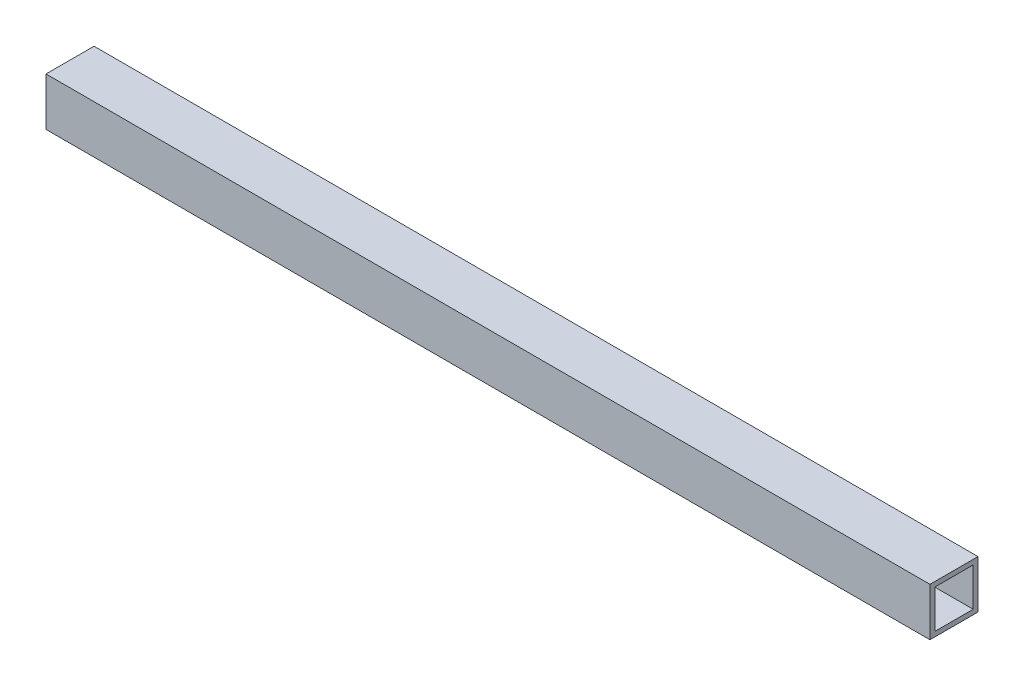
ISO-10303-21;
HEADER;
FILE_DESCRIPTION(('STEP AP214'),'2;1');
FILE_NAME('part.step','',(''),(''),'','','');
FILE_SCHEMA(('AUTOMOTIVE_DESIGN { 1 0 10303 214 1 1 1 1 }'));
ENDSEC;
DATA;
#1=APPLICATION_CONTEXT('core data for automotive mechanical design processes');
#2=APPLICATION_PROTOCOL_DEFINITION('international standard','automotive_design',2000,#1);
#3=PRODUCT_CONTEXT('',#1,'mechanical');
#4=PRODUCT('Part','Part','',(#3));
#5=PRODUCT_RELATED_PRODUCT_CATEGORY('part','',(#4));
#6=PRODUCT_DEFINITION_FORMATION('','',#4);
#7=PRODUCT_DEFINITION_CONTEXT('part definition',#1,'design');
#8=PRODUCT_DEFINITION('design','',#6,#7);
#9=PRODUCT_DEFINITION_SHAPE('','',#8);
#10=(LENGTH_UNIT() NAMED_UNIT(*) SI_UNIT(.MILLI.,.METRE.));
#11=(NAMED_UNIT(*) PLANE_ANGLE_UNIT() SI_UNIT($,.RADIAN.));
#12=(NAMED_UNIT(*) SI_UNIT($,.STERADIAN.) SOLID_ANGLE_UNIT());
#13=UNCERTAINTY_MEASURE_WITH_UNIT(LENGTH_MEASURE(1.E-05),#10,'distance_accuracy_value','');
#14=(GEOMETRIC_REPRESENTATION_CONTEXT(3) GLOBAL_UNCERTAINTY_ASSIGNED_CONTEXT((#13)) GLOBAL_UNIT_ASSIGNED_CONTEXT((#10,
#11,#12)) REPRESENTATION_CONTEXT('',''));
#15=CARTESIAN_POINT('',(0.,0.,0.));
#16=DIRECTION('',(0.,0.,1.));
#17=DIRECTION('',(1.,0.,0.));
#18=AXIS2_PLACEMENT_3D('',#15,#16,#17);
#19=CARTESIAN_POINT('',(584.2,0.,0.));
#20=DIRECTION('',(1.,0.,0.));
#21=DIRECTION('',(0.,0.,-1.));
#22=AXIS2_PLACEMENT_3D('',#19,#20,#21);
#23=PLANE('',#22);
#24=DIRECTION('',(0.,-1.,0.));
#25=VECTOR('',#24,1.);
#26=CARTESIAN_POINT('',(584.2,0.,3.175));
#27=LINE('',#26,#25);
#28=CARTESIAN_POINT('',(584.2,28.575,3.175));
#29=VERTEX_POINT('',#28);
#30=CARTESIAN_POINT('',(584.2,-3.175,3.175));
#31=VERTEX_POINT('',#30);
#32=EDGE_CURVE('E158',#29,#31,#27,.T.);
#33=ORIENTED_EDGE('',*,*,#32,.T.);
#34=DIRECTION('',(0.,0.,-1.));
#35=VECTOR('',#34,1.);
#36=CARTESIAN_POINT('',(584.2,-3.175,0.));
#37=LINE('',#36,#35);
#38=CARTESIAN_POINT('',(584.2,-3.175,-28.575));
#39=VERTEX_POINT('',#38);
#40=EDGE_CURVE('E161',#31,#39,#37,.T.);
#41=ORIENTED_EDGE('',*,*,#40,.T.);
#42=DIRECTION('',(0.,1.,0.));
#43=VECTOR('',#42,1.);
#44=CARTESIAN_POINT('',(584.2,0.,-28.575));
#45=LINE('',#44,#43);
#46=CARTESIAN_POINT('',(584.2,28.575,-28.575));
#47=VERTEX_POINT('',#46);
#48=EDGE_CURVE('E164',#39,#47,#45,.T.);
#49=ORIENTED_EDGE('',*,*,#48,.T.);
#50=DIRECTION('',(0.,0.,1.));
#51=VECTOR('',#50,1.);
#52=CARTESIAN_POINT('',(584.2,28.575,0.));
#53=LINE('',#52,#51);
#54=EDGE_CURVE('E166',#47,#29,#53,.T.);
#55=ORIENTED_EDGE('',*,*,#54,.T.);
#56=EDGE_LOOP('',(#33,#41,#49,#55));
#57=FACE_BOUND('',#56,.T.);
#58=DIRECTION('',(0.,0.,-1.));
#59=VECTOR('',#58,1.);
#60=CARTESIAN_POINT('',(584.2,0.,0.));
#61=LINE('',#60,#59);
#62=CARTESIAN_POINT('',(584.2,0.,0.));
#63=VERTEX_POINT('',#62);
#64=CARTESIAN_POINT('',(584.2,0.,-25.4));
#65=VERTEX_POINT('',#64);
#66=EDGE_CURVE('E130',#63,#65,#61,.T.);
#67=ORIENTED_EDGE('',*,*,#66,.F.);
#68=DIRECTION('',(0.,-1.,0.));
#69=VECTOR('',#68,1.);
#70=CARTESIAN_POINT('',(584.2,0.,0.));
#71=LINE('',#70,#69);
#72=CARTESIAN_POINT('',(584.2,25.4,0.));
#73=VERTEX_POINT('',#72);
#74=EDGE_CURVE('E122',#73,#63,#71,.T.);
#75=ORIENTED_EDGE('',*,*,#74,.F.);
#76=DIRECTION('',(0.,0.,1.));
#77=VECTOR('',#76,1.);
#78=CARTESIAN_POINT('',(584.2,25.4,0.));
#79=LINE('',#78,#77);
#80=CARTESIAN_POINT('',(584.2,25.4,-25.4));
#81=VERTEX_POINT('',#80);
#82=EDGE_CURVE('E144',#81,#73,#79,.T.);
#83=ORIENTED_EDGE('',*,*,#82,.F.);
#84=DIRECTION('',(0.,1.,0.));
#85=VECTOR('',#84,1.);
#86=CARTESIAN_POINT('',(584.2,0.,-25.4));
#87=LINE('',#86,#85);
#88=EDGE_CURVE('E142',#65,#81,#87,.T.);
#89=ORIENTED_EDGE('',*,*,#88,.F.);
#90=EDGE_LOOP('',(#67,#75,#83,#89));
#91=FACE_BOUND('',#90,.T.);
#92=ADVANCED_FACE('F57',(#57,#91),#23,.T.);
#93=CARTESIAN_POINT('',(0.,0.,0.));
#94=DIRECTION('',(1.,0.,0.));
#95=DIRECTION('',(0.,0.,-1.));
#96=AXIS2_PLACEMENT_3D('',#93,#94,#95);
#97=PLANE('',#96);
#98=DIRECTION('',(0.,-1.,0.));
#99=VECTOR('',#98,1.);
#100=CARTESIAN_POINT('',(0.,0.,3.175));
#101=LINE('',#100,#99);
#102=CARTESIAN_POINT('',(0.,28.575,3.175));
#103=VERTEX_POINT('',#102);
#104=CARTESIAN_POINT('',(0.,-3.175,3.175));
#105=VERTEX_POINT('',#104);
#106=EDGE_CURVE('E138',#103,#105,#101,.T.);
#107=ORIENTED_EDGE('',*,*,#106,.F.);
#108=DIRECTION('',(0.,0.,1.));
#109=VECTOR('',#108,1.);
#110=CARTESIAN_POINT('',(0.,28.575,0.));
#111=LINE('',#110,#109);
#112=CARTESIAN_POINT('',(0.,28.575,-28.575));
#113=VERTEX_POINT('',#112);
#114=EDGE_CURVE('E162',#113,#103,#111,.T.);
#115=ORIENTED_EDGE('',*,*,#114,.F.);
#116=DIRECTION('',(0.,1.,0.));
#117=VECTOR('',#116,1.);
#118=CARTESIAN_POINT('',(0.,0.,-28.575));
#119=LINE('',#118,#117);
#120=CARTESIAN_POINT('',(0.,-3.175,-28.575));
#121=VERTEX_POINT('',#120);
#122=EDGE_CURVE('E173',#121,#113,#119,.T.);
#123=ORIENTED_EDGE('',*,*,#122,.F.);
#124=DIRECTION('',(0.,0.,-1.));
#125=VECTOR('',#124,1.);
#126=CARTESIAN_POINT('',(0.,-3.175,0.));
#127=LINE('',#126,#125);
#128=EDGE_CURVE('E171',#105,#121,#127,.T.);
#129=ORIENTED_EDGE('',*,*,#128,.F.);
#130=EDGE_LOOP('',(#107,#115,#123,#129));
#131=FACE_BOUND('',#130,.T.);
#132=DIRECTION('',(0.,-1.,0.));
#133=VECTOR('',#132,1.);
#134=CARTESIAN_POINT('',(0.,0.,0.));
#135=LINE('',#134,#133);
#136=CARTESIAN_POINT('',(0.,25.4,0.));
#137=VERTEX_POINT('',#136);
#138=CARTESIAN_POINT('',(0.,0.,0.));
#139=VERTEX_POINT('',#138);
#140=EDGE_CURVE('E80',#137,#139,#135,.T.);
#141=ORIENTED_EDGE('',*,*,#140,.T.);
#142=DIRECTION('',(0.,0.,-1.));
#143=VECTOR('',#142,1.);
#144=CARTESIAN_POINT('',(0.,0.,0.));
#145=LINE('',#144,#143);
#146=CARTESIAN_POINT('',(0.,0.,-25.4));
#147=VERTEX_POINT('',#146);
#148=EDGE_CURVE('E137',#139,#147,#145,.T.);
#149=ORIENTED_EDGE('',*,*,#148,.T.);
#150=DIRECTION('',(0.,1.,0.));
#151=VECTOR('',#150,1.);
#152=CARTESIAN_POINT('',(0.,0.,-25.4));
#153=LINE('',#152,#151);
#154=CARTESIAN_POINT('',(0.,25.4,-25.4));
#155=VERTEX_POINT('',#154);
#156=EDGE_CURVE('E150',#147,#155,#153,.T.);
#157=ORIENTED_EDGE('',*,*,#156,.T.);
#158=DIRECTION('',(0.,0.,1.));
#159=VECTOR('',#158,1.);
#160=CARTESIAN_POINT('',(0.,25.4,0.));
#161=LINE('',#160,#159);
#162=EDGE_CURVE('E131',#155,#137,#161,.T.);
#163=ORIENTED_EDGE('',*,*,#162,.T.);
#164=EDGE_LOOP('',(#141,#149,#157,#163));
#165=FACE_BOUND('',#164,.T.);
#166=ADVANCED_FACE('F191',(#131,#165),#97,.F.);
#167=CARTESIAN_POINT('',(584.2,0.,3.175));
#168=DIRECTION('',(0.,0.,-1.));
#169=DIRECTION('',(-1.,0.,0.));
#170=AXIS2_PLACEMENT_3D('',#167,#168,#169);
#171=PLANE('',#170);
#172=ORIENTED_EDGE('',*,*,#106,.T.);
#173=DIRECTION('',(-1.,0.,0.));
#174=VECTOR('',#173,1.);
#175=CARTESIAN_POINT('',(584.2,-3.175,3.175));
#176=LINE('',#175,#174);
#177=EDGE_CURVE('E12',#31,#105,#176,.T.);
#178=ORIENTED_EDGE('',*,*,#177,.F.);
#179=ORIENTED_EDGE('',*,*,#32,.F.);
#180=DIRECTION('',(-1.,0.,0.));
#181=VECTOR('',#180,1.);
#182=CARTESIAN_POINT('',(584.2,28.575,3.175));
#183=LINE('',#182,#181);
#184=EDGE_CURVE('E168',#29,#103,#183,.T.);
#185=ORIENTED_EDGE('',*,*,#184,.T.);
#186=EDGE_LOOP('',(#172,#178,#179,#185));
#187=FACE_BOUND('',#186,.T.);
#188=ADVANCED_FACE('F59',(#187),#171,.F.);
#189=CARTESIAN_POINT('',(584.2,-3.175,0.));
#190=DIRECTION('',(0.,1.,0.));
#191=DIRECTION('',(0.,0.,1.));
#192=AXIS2_PLACEMENT_3D('',#189,#190,#191);
#193=PLANE('',#192);
#194=ORIENTED_EDGE('',*,*,#128,.T.);
#195=DIRECTION('',(-1.,0.,0.));
#196=VECTOR('',#195,1.);
#197=CARTESIAN_POINT('',(584.2,-3.175,-28.575));
#198=LINE('',#197,#196);
#199=EDGE_CURVE('E65',#39,#121,#198,.T.);
#200=ORIENTED_EDGE('',*,*,#199,.F.);
#201=ORIENTED_EDGE('',*,*,#40,.F.);
#202=ORIENTED_EDGE('',*,*,#177,.T.);
#203=EDGE_LOOP('',(#194,#200,#201,#202));
#204=FACE_BOUND('',#203,.T.);
#205=ADVANCED_FACE('F201',(#204),#193,.F.);
#206=CARTESIAN_POINT('',(584.2,0.,-28.575));
#207=DIRECTION('',(0.,0.,1.));
#208=DIRECTION('',(1.,0.,0.));
#209=AXIS2_PLACEMENT_3D('',#206,#207,#208);
#210=PLANE('',#209);
#211=ORIENTED_EDGE('',*,*,#122,.T.);
#212=DIRECTION('',(-1.,0.,0.));
#213=VECTOR('',#212,1.);
#214=CARTESIAN_POINT('',(584.2,28.575,-28.575));
#215=LINE('',#214,#213);
#216=EDGE_CURVE('E178',#47,#113,#215,.T.);
#217=ORIENTED_EDGE('',*,*,#216,.F.);
#218=ORIENTED_EDGE('',*,*,#48,.F.);
#219=ORIENTED_EDGE('',*,*,#199,.T.);
#220=EDGE_LOOP('',(#211,#217,#218,#219));
#221=FACE_BOUND('',#220,.T.);
#222=ADVANCED_FACE('F185',(#221),#210,.F.);
#223=CARTESIAN_POINT('',(584.2,28.575,0.));
#224=DIRECTION('',(0.,-1.,0.));
#225=DIRECTION('',(0.,0.,-1.));
#226=AXIS2_PLACEMENT_3D('',#223,#224,#225);
#227=PLANE('',#226);
#228=ORIENTED_EDGE('',*,*,#114,.T.);
#229=ORIENTED_EDGE('',*,*,#184,.F.);
#230=ORIENTED_EDGE('',*,*,#54,.F.);
#231=ORIENTED_EDGE('',*,*,#216,.T.);
#232=EDGE_LOOP('',(#228,#229,#230,#231));
#233=FACE_BOUND('',#232,.T.);
#234=ADVANCED_FACE('F195',(#233),#227,.F.);
#235=CARTESIAN_POINT('',(584.2,0.,0.));
#236=DIRECTION('',(0.,0.,-1.));
#237=DIRECTION('',(-1.,0.,0.));
#238=AXIS2_PLACEMENT_3D('',#235,#236,#237);
#239=PLANE('',#238);
#240=ORIENTED_EDGE('',*,*,#140,.F.);
#241=DIRECTION('',(-1.,0.,0.));
#242=VECTOR('',#241,1.);
#243=CARTESIAN_POINT('',(584.2,25.4,0.));
#244=LINE('',#243,#242);
#245=EDGE_CURVE('E126',#73,#137,#244,.T.);
#246=ORIENTED_EDGE('',*,*,#245,.F.);
#247=ORIENTED_EDGE('',*,*,#74,.T.);
#248=DIRECTION('',(-1.,0.,0.));
#249=VECTOR('',#248,1.);
#250=CARTESIAN_POINT('',(584.2,0.,0.));
#251=LINE('',#250,#249);
#252=EDGE_CURVE('E125',#63,#139,#251,.T.);
#253=ORIENTED_EDGE('',*,*,#252,.T.);
#254=EDGE_LOOP('',(#240,#246,#247,#253));
#255=FACE_BOUND('',#254,.T.);
#256=ADVANCED_FACE('F124',(#255),#239,.T.);
#257=CARTESIAN_POINT('',(584.2,0.,0.));
#258=DIRECTION('',(0.,1.,0.));
#259=DIRECTION('',(0.,0.,1.));
#260=AXIS2_PLACEMENT_3D('',#257,#258,#259);
#261=PLANE('',#260);
#262=ORIENTED_EDGE('',*,*,#148,.F.);
#263=ORIENTED_EDGE('',*,*,#252,.F.);
#264=ORIENTED_EDGE('',*,*,#66,.T.);
#265=DIRECTION('',(-1.,0.,0.));
#266=VECTOR('',#265,1.);
#267=CARTESIAN_POINT('',(584.2,0.,-25.4));
#268=LINE('',#267,#266);
#269=EDGE_CURVE('E139',#65,#147,#268,.T.);
#270=ORIENTED_EDGE('',*,*,#269,.T.);
#271=EDGE_LOOP('',(#262,#263,#264,#270));
#272=FACE_BOUND('',#271,.T.);
#273=ADVANCED_FACE('F134',(#272),#261,.T.);
#274=CARTESIAN_POINT('',(584.2,0.,-25.4));
#275=DIRECTION('',(0.,0.,1.));
#276=DIRECTION('',(1.,0.,0.));
#277=AXIS2_PLACEMENT_3D('',#274,#275,#276);
#278=PLANE('',#277);
#279=ORIENTED_EDGE('',*,*,#156,.F.);
#280=ORIENTED_EDGE('',*,*,#269,.F.);
#281=ORIENTED_EDGE('',*,*,#88,.T.);
#282=DIRECTION('',(-1.,0.,0.));
#283=VECTOR('',#282,1.);
#284=CARTESIAN_POINT('',(584.2,25.4,-25.4));
#285=LINE('',#284,#283);
#286=EDGE_CURVE('E72',#81,#155,#285,.T.);
#287=ORIENTED_EDGE('',*,*,#286,.T.);
#288=EDGE_LOOP('',(#279,#280,#281,#287));
#289=FACE_BOUND('',#288,.T.);
#290=ADVANCED_FACE('F224',(#289),#278,.T.);
#291=CARTESIAN_POINT('',(584.2,25.4,0.));
#292=DIRECTION('',(0.,-1.,0.));
#293=DIRECTION('',(0.,0.,-1.));
#294=AXIS2_PLACEMENT_3D('',#291,#292,#293);
#295=PLANE('',#294);
#296=ORIENTED_EDGE('',*,*,#162,.F.);
#297=ORIENTED_EDGE('',*,*,#286,.F.);
#298=ORIENTED_EDGE('',*,*,#82,.T.);
#299=ORIENTED_EDGE('',*,*,#245,.T.);
#300=EDGE_LOOP('',(#296,#297,#298,#299));
#301=FACE_BOUND('',#300,.T.);
#302=ADVANCED_FACE('F228',(#301),#295,.T.);
#303=CLOSED_SHELL('',(#92,#166,#188,#205,#222,#234,#256,#273,#290,#302));
#304=MANIFOLD_SOLID_BREP('B2',#303);
#305=ADVANCED_BREP_SHAPE_REPRESENTATION('',(#18,#304),#14);
#306=SHAPE_DEFINITION_REPRESENTATION(#9,#305);
ENDSEC;
END-ISO-10303-21;
